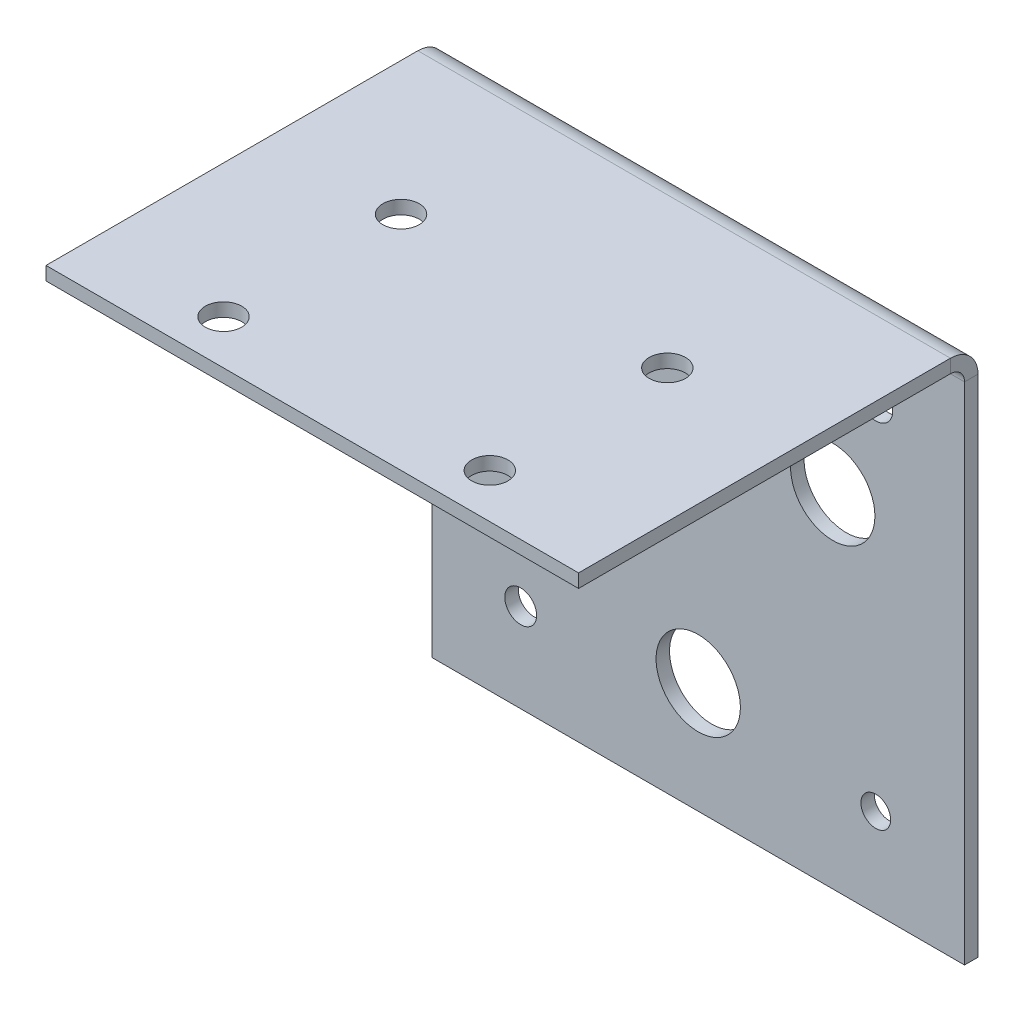
ISO-10303-21;
HEADER;
FILE_DESCRIPTION(('STEP AP214'),'2;1');
FILE_NAME('part.step','',(''),(''),'','','');
FILE_SCHEMA(('AUTOMOTIVE_DESIGN { 1 0 10303 214 1 1 1 1 }'));
ENDSEC;
DATA;
#1=APPLICATION_CONTEXT('core data for automotive mechanical design processes');
#2=APPLICATION_PROTOCOL_DEFINITION('international standard','automotive_design',2000,#1);
#3=PRODUCT_CONTEXT('',#1,'mechanical');
#4=PRODUCT('Part','Part','',(#3));
#5=PRODUCT_RELATED_PRODUCT_CATEGORY('part','',(#4));
#6=PRODUCT_DEFINITION_FORMATION('','',#4);
#7=PRODUCT_DEFINITION_CONTEXT('part definition',#1,'design');
#8=PRODUCT_DEFINITION('design','',#6,#7);
#9=PRODUCT_DEFINITION_SHAPE('','',#8);
#10=(LENGTH_UNIT() NAMED_UNIT(*) SI_UNIT(.MILLI.,.METRE.));
#11=(NAMED_UNIT(*) PLANE_ANGLE_UNIT() SI_UNIT($,.RADIAN.));
#12=(NAMED_UNIT(*) SI_UNIT($,.STERADIAN.) SOLID_ANGLE_UNIT());
#13=UNCERTAINTY_MEASURE_WITH_UNIT(LENGTH_MEASURE(1.E-05),#10,'distance_accuracy_value','');
#14=(GEOMETRIC_REPRESENTATION_CONTEXT(3) GLOBAL_UNCERTAINTY_ASSIGNED_CONTEXT((#13)) GLOBAL_UNIT_ASSIGNED_CONTEXT((#10,
#11,#12)) REPRESENTATION_CONTEXT('',''));
#15=CARTESIAN_POINT('',(0.,0.,0.));
#16=DIRECTION('',(0.,0.,1.));
#17=DIRECTION('',(1.,0.,0.));
#18=AXIS2_PLACEMENT_3D('',#15,#16,#17);
#19=CARTESIAN_POINT('',(-60.,60.,-3.03784));
#20=DIRECTION('',(-1.,0.,0.));
#21=DIRECTION('',(0.,-1.,0.));
#22=AXIS2_PLACEMENT_3D('',#19,#20,#21);
#23=PLANE('',#22);
#24=DIRECTION('',(0.,-1.,0.));
#25=VECTOR('',#24,1.);
#26=CARTESIAN_POINT('',(-60.,60.,0.));
#27=LINE('',#26,#25);
#28=CARTESIAN_POINT('',(-60.,53.78716,0.));
#29=VERTEX_POINT('',#28);
#30=CARTESIAN_POINT('',(-60.,-60.,0.));
#31=VERTEX_POINT('',#30);
#32=EDGE_CURVE('E104',#29,#31,#27,.T.);
#33=ORIENTED_EDGE('',*,*,#32,.F.);
#34=DIRECTION('',(0.,0.,-1.));
#35=VECTOR('',#34,1.);
#36=CARTESIAN_POINT('',(-60.,53.78716,0.));
#37=LINE('',#36,#35);
#38=CARTESIAN_POINT('',(-60.,53.78716,-3.03784));
#39=VERTEX_POINT('',#38);
#40=EDGE_CURVE('E134',#29,#39,#37,.T.);
#41=ORIENTED_EDGE('',*,*,#40,.T.);
#42=DIRECTION('',(0.,-1.,0.));
#43=VECTOR('',#42,1.);
#44=CARTESIAN_POINT('',(-60.,60.,-3.03784));
#45=LINE('',#44,#43);
#46=CARTESIAN_POINT('',(-60.,-60.,-3.03784));
#47=VERTEX_POINT('',#46);
#48=EDGE_CURVE('E111',#39,#47,#45,.T.);
#49=ORIENTED_EDGE('',*,*,#48,.T.);
#50=DIRECTION('',(0.,0.,1.));
#51=VECTOR('',#50,1.);
#52=CARTESIAN_POINT('',(-60.,-60.,-3.03784));
#53=LINE('',#52,#51);
#54=EDGE_CURVE('E63',#47,#31,#53,.T.);
#55=ORIENTED_EDGE('',*,*,#54,.T.);
#56=EDGE_LOOP('',(#33,#41,#49,#55));
#57=FACE_BOUND('',#56,.T.);
#58=ADVANCED_FACE('F59',(#57),#23,.T.);
#59=CARTESIAN_POINT('',(0.,0.,-3.03784));
#60=DIRECTION('',(0.,0.,1.));
#61=DIRECTION('',(1.,0.,0.));
#62=AXIS2_PLACEMENT_3D('',#59,#60,#61);
#63=PLANE('',#62);
#64=CARTESIAN_POINT('',(40.,40.,-3.03784));
#65=DIRECTION('',(0.,0.,-1.));
#66=DIRECTION('',(-1.,0.,0.));
#67=AXIS2_PLACEMENT_3D('',#64,#65,#66);
#68=CIRCLE('',#67,3.82819430211079);
#69=CARTESIAN_POINT('',(36.1718056978892,40.,-3.03784));
#70=VERTEX_POINT('',#69);
#71=EDGE_CURVE('E224',#70,#70,#68,.T.);
#72=ORIENTED_EDGE('',*,*,#71,.F.);
#73=EDGE_LOOP('',(#72));
#74=FACE_BOUND('',#73,.T.);
#75=CARTESIAN_POINT('',(40.,-40.,-3.03784));
#76=DIRECTION('',(0.,0.,-1.));
#77=DIRECTION('',(-1.,0.,0.));
#78=AXIS2_PLACEMENT_3D('',#75,#76,#77);
#79=CIRCLE('',#78,3.34967001434688);
#80=CARTESIAN_POINT('',(36.6503299856531,-40.,-3.03784));
#81=VERTEX_POINT('',#80);
#82=EDGE_CURVE('E230',#81,#81,#79,.T.);
#83=ORIENTED_EDGE('',*,*,#82,.F.);
#84=EDGE_LOOP('',(#83));
#85=FACE_BOUND('',#84,.T.);
#86=CARTESIAN_POINT('',(-40.,-40.,-3.03784));
#87=DIRECTION('',(0.,0.,-1.));
#88=DIRECTION('',(-1.,0.,0.));
#89=AXIS2_PLACEMENT_3D('',#86,#87,#88);
#90=CIRCLE('',#89,3.58893215822946);
#91=CARTESIAN_POINT('',(-43.5889321582295,-40.,-3.03784));
#92=VERTEX_POINT('',#91);
#93=EDGE_CURVE('E218',#92,#92,#90,.T.);
#94=ORIENTED_EDGE('',*,*,#93,.F.);
#95=EDGE_LOOP('',(#94));
#96=FACE_BOUND('',#95,.T.);
#97=CARTESIAN_POINT('',(-40.,40.,-3.03784));
#98=DIRECTION('',(0.,0.,-1.));
#99=DIRECTION('',(-1.,0.,0.));
#100=AXIS2_PLACEMENT_3D('',#97,#98,#99);
#101=CIRCLE('',#100,3.82819430211112);
#102=CARTESIAN_POINT('',(-43.8281943021111,40.,-3.03784));
#103=VERTEX_POINT('',#102);
#104=EDGE_CURVE('E201',#103,#103,#101,.T.);
#105=ORIENTED_EDGE('',*,*,#104,.F.);
#106=EDGE_LOOP('',(#105));
#107=FACE_BOUND('',#106,.T.);
#108=CARTESIAN_POINT('',(0.,-35.,-3.03784));
#109=DIRECTION('',(0.,0.,1.));
#110=DIRECTION('',(1.,0.,0.));
#111=AXIS2_PLACEMENT_3D('',#108,#109,#110);
#112=CIRCLE('',#111,9.5);
#113=CARTESIAN_POINT('',(9.50000000000001,-35.,-3.03784));
#114=VERTEX_POINT('',#113);
#115=EDGE_CURVE('E105',#114,#114,#112,.T.);
#116=ORIENTED_EDGE('',*,*,#115,.T.);
#117=EDGE_LOOP('',(#116));
#118=FACE_BOUND('',#117,.T.);
#119=CARTESIAN_POINT('',(-30.3108891324553,17.4999999999999,-3.03784));
#120=DIRECTION('',(0.,0.,1.));
#121=DIRECTION('',(1.,0.,0.));
#122=AXIS2_PLACEMENT_3D('',#119,#120,#121);
#123=CIRCLE('',#122,9.5);
#124=CARTESIAN_POINT('',(-20.8108891324553,17.4999999999999,-3.03784));
#125=VERTEX_POINT('',#124);
#126=EDGE_CURVE('E120',#125,#125,#123,.T.);
#127=ORIENTED_EDGE('',*,*,#126,.T.);
#128=EDGE_LOOP('',(#127));
#129=FACE_BOUND('',#128,.T.);
#130=CARTESIAN_POINT('',(30.3108891324553,17.4999999999999,-3.03784));
#131=DIRECTION('',(0.,0.,1.));
#132=DIRECTION('',(1.,0.,0.));
#133=AXIS2_PLACEMENT_3D('',#130,#131,#132);
#134=CIRCLE('',#133,9.5);
#135=CARTESIAN_POINT('',(39.8108891324553,17.4999999999999,-3.03784));
#136=VERTEX_POINT('',#135);
#137=EDGE_CURVE('E126',#136,#136,#134,.T.);
#138=ORIENTED_EDGE('',*,*,#137,.T.);
#139=EDGE_LOOP('',(#138));
#140=FACE_BOUND('',#139,.T.);
#141=DIRECTION('',(-1.,0.,0.));
#142=VECTOR('',#141,1.);
#143=CARTESIAN_POINT('',(-60.,53.78716,-3.03784));
#144=LINE('',#143,#142);
#145=CARTESIAN_POINT('',(60.,53.7871600000001,-3.03784));
#146=VERTEX_POINT('',#145);
#147=EDGE_CURVE('E150',#39,#146,#144,.F.);
#148=ORIENTED_EDGE('',*,*,#147,.T.);
#149=DIRECTION('',(0.,1.,0.));
#150=VECTOR('',#149,1.);
#151=CARTESIAN_POINT('',(60.,60.,-3.03784));
#152=LINE('',#151,#150);
#153=CARTESIAN_POINT('',(60.,-60.,-3.03784));
#154=VERTEX_POINT('',#153);
#155=EDGE_CURVE('E109',#154,#146,#152,.T.);
#156=ORIENTED_EDGE('',*,*,#155,.F.);
#157=DIRECTION('',(1.,0.,0.));
#158=VECTOR('',#157,1.);
#159=CARTESIAN_POINT('',(-60.,-60.,-3.03784));
#160=LINE('',#159,#158);
#161=EDGE_CURVE('E98',#47,#154,#160,.T.);
#162=ORIENTED_EDGE('',*,*,#161,.F.);
#163=ORIENTED_EDGE('',*,*,#48,.F.);
#164=EDGE_LOOP('',(#148,#156,#162,#163));
#165=FACE_BOUND('',#164,.T.);
#166=ADVANCED_FACE('F241',(#74,#85,#96,#107,#118,#129,#140,#165),#63,.F.);
#167=CARTESIAN_POINT('',(0.,0.,0.));
#168=DIRECTION('',(0.,0.,1.));
#169=DIRECTION('',(1.,0.,0.));
#170=AXIS2_PLACEMENT_3D('',#167,#168,#169);
#171=PLANE('',#170);
#172=CARTESIAN_POINT('',(40.,40.,0.));
#173=DIRECTION('',(0.,0.,1.));
#174=DIRECTION('',(1.,0.,0.));
#175=AXIS2_PLACEMENT_3D('',#172,#173,#174);
#176=CIRCLE('',#175,3.82819430211079);
#177=CARTESIAN_POINT('',(43.8281943021108,40.,0.));
#178=VERTEX_POINT('',#177);
#179=EDGE_CURVE('E221',#178,#178,#176,.F.);
#180=ORIENTED_EDGE('',*,*,#179,.T.);
#181=EDGE_LOOP('',(#180));
#182=FACE_BOUND('',#181,.T.);
#183=CARTESIAN_POINT('',(40.,-40.,0.));
#184=DIRECTION('',(0.,0.,1.));
#185=DIRECTION('',(1.,0.,0.));
#186=AXIS2_PLACEMENT_3D('',#183,#184,#185);
#187=CIRCLE('',#186,3.34967001434688);
#188=CARTESIAN_POINT('',(43.3496700143469,-40.,0.));
#189=VERTEX_POINT('',#188);
#190=EDGE_CURVE('E227',#189,#189,#187,.F.);
#191=ORIENTED_EDGE('',*,*,#190,.T.);
#192=EDGE_LOOP('',(#191));
#193=FACE_BOUND('',#192,.T.);
#194=CARTESIAN_POINT('',(-40.,-40.,0.));
#195=DIRECTION('',(0.,0.,1.));
#196=DIRECTION('',(1.,0.,0.));
#197=AXIS2_PLACEMENT_3D('',#194,#195,#196);
#198=CIRCLE('',#197,3.58893215822946);
#199=CARTESIAN_POINT('',(-36.4110678417705,-40.,0.));
#200=VERTEX_POINT('',#199);
#201=EDGE_CURVE('E233',#200,#200,#198,.F.);
#202=ORIENTED_EDGE('',*,*,#201,.T.);
#203=EDGE_LOOP('',(#202));
#204=FACE_BOUND('',#203,.T.);
#205=CARTESIAN_POINT('',(-40.,40.,0.));
#206=DIRECTION('',(0.,0.,1.));
#207=DIRECTION('',(1.,0.,0.));
#208=AXIS2_PLACEMENT_3D('',#205,#206,#207);
#209=CIRCLE('',#208,3.82819430211112);
#210=CARTESIAN_POINT('',(-36.1718056978889,40.,0.));
#211=VERTEX_POINT('',#210);
#212=EDGE_CURVE('E215',#211,#211,#209,.F.);
#213=ORIENTED_EDGE('',*,*,#212,.T.);
#214=EDGE_LOOP('',(#213));
#215=FACE_BOUND('',#214,.T.);
#216=CARTESIAN_POINT('',(30.3108891324553,17.4999999999999,0.));
#217=DIRECTION('',(0.,0.,1.));
#218=DIRECTION('',(1.,0.,0.));
#219=AXIS2_PLACEMENT_3D('',#216,#217,#218);
#220=CIRCLE('',#219,9.5);
#221=CARTESIAN_POINT('',(39.8108891324553,17.4999999999999,0.));
#222=VERTEX_POINT('',#221);
#223=EDGE_CURVE('E129',#222,#222,#220,.T.);
#224=ORIENTED_EDGE('',*,*,#223,.F.);
#225=EDGE_LOOP('',(#224));
#226=FACE_BOUND('',#225,.T.);
#227=CARTESIAN_POINT('',(-30.3108891324553,17.4999999999999,0.));
#228=DIRECTION('',(0.,0.,1.));
#229=DIRECTION('',(1.,0.,0.));
#230=AXIS2_PLACEMENT_3D('',#227,#228,#229);
#231=CIRCLE('',#230,9.5);
#232=CARTESIAN_POINT('',(-20.8108891324553,17.4999999999999,0.));
#233=VERTEX_POINT('',#232);
#234=EDGE_CURVE('E123',#233,#233,#231,.T.);
#235=ORIENTED_EDGE('',*,*,#234,.F.);
#236=EDGE_LOOP('',(#235));
#237=FACE_BOUND('',#236,.T.);
#238=CARTESIAN_POINT('',(0.,-35.,0.));
#239=DIRECTION('',(0.,0.,1.));
#240=DIRECTION('',(1.,0.,0.));
#241=AXIS2_PLACEMENT_3D('',#238,#239,#240);
#242=CIRCLE('',#241,9.5);
#243=CARTESIAN_POINT('',(9.50000000000001,-35.,0.));
#244=VERTEX_POINT('',#243);
#245=EDGE_CURVE('E117',#244,#244,#242,.T.);
#246=ORIENTED_EDGE('',*,*,#245,.F.);
#247=EDGE_LOOP('',(#246));
#248=FACE_BOUND('',#247,.T.);
#249=DIRECTION('',(0.,1.,0.));
#250=VECTOR('',#249,1.);
#251=CARTESIAN_POINT('',(60.,60.,0.));
#252=LINE('',#251,#250);
#253=CARTESIAN_POINT('',(60.,-60.,0.));
#254=VERTEX_POINT('',#253);
#255=CARTESIAN_POINT('',(60.,53.78716,0.));
#256=VERTEX_POINT('',#255);
#257=EDGE_CURVE('E100',#254,#256,#252,.T.);
#258=ORIENTED_EDGE('',*,*,#257,.T.);
#259=DIRECTION('',(-1.,0.,0.));
#260=VECTOR('',#259,1.);
#261=CARTESIAN_POINT('',(-60.,53.78716,0.));
#262=LINE('',#261,#260);
#263=EDGE_CURVE('E74',#29,#256,#262,.F.);
#264=ORIENTED_EDGE('',*,*,#263,.F.);
#265=ORIENTED_EDGE('',*,*,#32,.T.);
#266=DIRECTION('',(1.,0.,0.));
#267=VECTOR('',#266,1.);
#268=CARTESIAN_POINT('',(-60.,-60.,0.));
#269=LINE('',#268,#267);
#270=EDGE_CURVE('E96',#31,#254,#269,.T.);
#271=ORIENTED_EDGE('',*,*,#270,.T.);
#272=EDGE_LOOP('',(#258,#264,#265,#271));
#273=FACE_BOUND('',#272,.T.);
#274=ADVANCED_FACE('F107',(#182,#193,#204,#215,#226,#237,#248,#273),#171,.T.);
#275=CARTESIAN_POINT('',(60.,60.,-3.03784));
#276=DIRECTION('',(1.,0.,0.));
#277=DIRECTION('',(0.,1.,0.));
#278=AXIS2_PLACEMENT_3D('',#275,#276,#277);
#279=PLANE('',#278);
#280=DIRECTION('',(0.,0.,-1.));
#281=VECTOR('',#280,1.);
#282=CARTESIAN_POINT('',(60.,53.78716,0.));
#283=LINE('',#282,#281);
#284=EDGE_CURVE('E103',#256,#146,#283,.T.);
#285=ORIENTED_EDGE('',*,*,#284,.F.);
#286=ORIENTED_EDGE('',*,*,#257,.F.);
#287=DIRECTION('',(0.,0.,1.));
#288=VECTOR('',#287,1.);
#289=CARTESIAN_POINT('',(60.,-60.,-3.03784));
#290=LINE('',#289,#288);
#291=EDGE_CURVE('E13',#154,#254,#290,.T.);
#292=ORIENTED_EDGE('',*,*,#291,.F.);
#293=ORIENTED_EDGE('',*,*,#155,.T.);
#294=EDGE_LOOP('',(#285,#286,#292,#293));
#295=FACE_BOUND('',#294,.T.);
#296=ADVANCED_FACE('F61',(#295),#279,.T.);
#297=CARTESIAN_POINT('',(-60.,-60.,-3.03784));
#298=DIRECTION('',(0.,-1.,0.));
#299=DIRECTION('',(1.,0.,0.));
#300=AXIS2_PLACEMENT_3D('',#297,#298,#299);
#301=PLANE('',#300);
#302=ORIENTED_EDGE('',*,*,#270,.F.);
#303=ORIENTED_EDGE('',*,*,#54,.F.);
#304=ORIENTED_EDGE('',*,*,#161,.T.);
#305=ORIENTED_EDGE('',*,*,#291,.T.);
#306=EDGE_LOOP('',(#302,#303,#304,#305));
#307=FACE_BOUND('',#306,.T.);
#308=ADVANCED_FACE('F93',(#307),#301,.T.);
#309=CARTESIAN_POINT('',(0.,-35.,-3.03784));
#310=DIRECTION('',(0.,0.,1.));
#311=DIRECTION('',(1.,0.,0.));
#312=AXIS2_PLACEMENT_3D('',#309,#310,#311);
#313=CYLINDRICAL_SURFACE('',#312,9.5);
#314=ORIENTED_EDGE('',*,*,#115,.F.);
#315=EDGE_LOOP('',(#314));
#316=FACE_BOUND('',#315,.T.);
#317=ORIENTED_EDGE('',*,*,#245,.T.);
#318=EDGE_LOOP('',(#317));
#319=FACE_BOUND('',#318,.T.);
#320=ADVANCED_FACE('F314',(#316,#319),#313,.F.);
#321=CARTESIAN_POINT('',(-30.3108891324553,17.4999999999999,-3.03784));
#322=DIRECTION('',(0.,0.,1.));
#323=DIRECTION('',(1.,0.,0.));
#324=AXIS2_PLACEMENT_3D('',#321,#322,#323);
#325=CYLINDRICAL_SURFACE('',#324,9.5);
#326=ORIENTED_EDGE('',*,*,#126,.F.);
#327=EDGE_LOOP('',(#326));
#328=FACE_BOUND('',#327,.T.);
#329=ORIENTED_EDGE('',*,*,#234,.T.);
#330=EDGE_LOOP('',(#329));
#331=FACE_BOUND('',#330,.T.);
#332=ADVANCED_FACE('F320',(#328,#331),#325,.F.);
#333=CARTESIAN_POINT('',(30.3108891324553,17.4999999999999,-3.03784));
#334=DIRECTION('',(0.,0.,1.));
#335=DIRECTION('',(1.,0.,0.));
#336=AXIS2_PLACEMENT_3D('',#333,#334,#335);
#337=CYLINDRICAL_SURFACE('',#336,9.5);
#338=ORIENTED_EDGE('',*,*,#137,.F.);
#339=EDGE_LOOP('',(#338));
#340=FACE_BOUND('',#339,.T.);
#341=ORIENTED_EDGE('',*,*,#223,.T.);
#342=EDGE_LOOP('',(#341));
#343=FACE_BOUND('',#342,.T.);
#344=ADVANCED_FACE('F324',(#340,#343),#337,.F.);
#345=CARTESIAN_POINT('',(60.,53.78716,3.175));
#346=DIRECTION('',(1.,0.,0.));
#347=DIRECTION('',(0.,0.,-1.));
#348=AXIS2_PLACEMENT_3D('',#345,#346,#347);
#349=PLANE('',#348);
#350=DIRECTION('',(0.,-1.,0.));
#351=VECTOR('',#350,1.);
#352=CARTESIAN_POINT('',(60.,60.,3.17499999999998));
#353=LINE('',#352,#351);
#354=CARTESIAN_POINT('',(60.,56.96216,3.17499999999999));
#355=VERTEX_POINT('',#354);
#356=CARTESIAN_POINT('',(60.,60.,3.17499999999998));
#357=VERTEX_POINT('',#356);
#358=EDGE_CURVE('E155',#355,#357,#353,.F.);
#359=ORIENTED_EDGE('',*,*,#358,.F.);
#360=CARTESIAN_POINT('',(60.,53.78716,3.175));
#361=DIRECTION('',(-1.,0.,0.));
#362=DIRECTION('',(0.,0.,1.));
#363=AXIS2_PLACEMENT_3D('',#360,#361,#362);
#364=CIRCLE('',#363,3.175);
#365=EDGE_CURVE('E144',#256,#355,#364,.F.);
#366=ORIENTED_EDGE('',*,*,#365,.F.);
#367=ORIENTED_EDGE('',*,*,#284,.T.);
#368=CARTESIAN_POINT('',(60.,53.78716,3.175));
#369=DIRECTION('',(-1.,0.,0.));
#370=DIRECTION('',(0.,0.,1.));
#371=AXIS2_PLACEMENT_3D('',#368,#369,#370);
#372=CIRCLE('',#371,6.21284);
#373=EDGE_CURVE('E137',#146,#357,#372,.F.);
#374=ORIENTED_EDGE('',*,*,#373,.T.);
#375=EDGE_LOOP('',(#359,#366,#367,#374));
#376=FACE_BOUND('',#375,.T.);
#377=ADVANCED_FACE('F263',(#376),#349,.T.);
#378=CARTESIAN_POINT('',(-60.,53.78716,3.17499999999999));
#379=DIRECTION('',(1.,0.,0.));
#380=DIRECTION('',(0.,0.,-1.));
#381=AXIS2_PLACEMENT_3D('',#378,#379,#380);
#382=PLANE('',#381);
#383=CARTESIAN_POINT('',(-60.,53.78716,3.17499999999999));
#384=DIRECTION('',(-1.,0.,0.));
#385=DIRECTION('',(0.,0.,1.));
#386=AXIS2_PLACEMENT_3D('',#383,#384,#385);
#387=CIRCLE('',#386,3.175);
#388=CARTESIAN_POINT('',(-60.,56.96216,3.17499999999998));
#389=VERTEX_POINT('',#388);
#390=EDGE_CURVE('E139',#389,#29,#387,.T.);
#391=ORIENTED_EDGE('',*,*,#390,.F.);
#392=DIRECTION('',(0.,-1.,0.));
#393=VECTOR('',#392,1.);
#394=CARTESIAN_POINT('',(-60.,56.96216,3.17499999999998));
#395=LINE('',#394,#393);
#396=CARTESIAN_POINT('',(-60.,60.,3.17499999999997));
#397=VERTEX_POINT('',#396);
#398=EDGE_CURVE('E162',#389,#397,#395,.F.);
#399=ORIENTED_EDGE('',*,*,#398,.T.);
#400=CARTESIAN_POINT('',(-60.,53.78716,3.17499999999999));
#401=DIRECTION('',(-1.,0.,0.));
#402=DIRECTION('',(0.,0.,1.));
#403=AXIS2_PLACEMENT_3D('',#400,#401,#402);
#404=CIRCLE('',#403,6.21284);
#405=EDGE_CURVE('E147',#397,#39,#404,.T.);
#406=ORIENTED_EDGE('',*,*,#405,.T.);
#407=ORIENTED_EDGE('',*,*,#40,.F.);
#408=EDGE_LOOP('',(#391,#399,#406,#407));
#409=FACE_BOUND('',#408,.T.);
#410=ADVANCED_FACE('F306',(#409),#382,.F.);
#411=CARTESIAN_POINT('',(-60.,53.78716,3.17499999999999));
#412=DIRECTION('',(-1.,0.,0.));
#413=DIRECTION('',(0.,1.,0.));
#414=AXIS2_PLACEMENT_3D('',#411,#412,#413);
#415=CYLINDRICAL_SURFACE('',#414,6.21284);
#416=ORIENTED_EDGE('',*,*,#147,.F.);
#417=ORIENTED_EDGE('',*,*,#405,.F.);
#418=DIRECTION('',(-1.,0.,0.));
#419=VECTOR('',#418,1.);
#420=CARTESIAN_POINT('',(60.,60.,3.17499999999998));
#421=LINE('',#420,#419);
#422=EDGE_CURVE('E165',#397,#357,#421,.F.);
#423=ORIENTED_EDGE('',*,*,#422,.T.);
#424=ORIENTED_EDGE('',*,*,#373,.F.);
#425=EDGE_LOOP('',(#416,#417,#423,#424));
#426=FACE_BOUND('',#425,.T.);
#427=ADVANCED_FACE('F265',(#426),#415,.T.);
#428=CARTESIAN_POINT('',(-60.,53.78716,3.17499999999999));
#429=DIRECTION('',(-1.,0.,0.));
#430=DIRECTION('',(0.,1.,0.));
#431=AXIS2_PLACEMENT_3D('',#428,#429,#430);
#432=CYLINDRICAL_SURFACE('',#431,3.175);
#433=ORIENTED_EDGE('',*,*,#263,.T.);
#434=ORIENTED_EDGE('',*,*,#365,.T.);
#435=DIRECTION('',(-1.,0.,0.));
#436=VECTOR('',#435,1.);
#437=CARTESIAN_POINT('',(60.,56.96216,3.17499999999999));
#438=LINE('',#437,#436);
#439=EDGE_CURVE('E158',#355,#389,#438,.T.);
#440=ORIENTED_EDGE('',*,*,#439,.T.);
#441=ORIENTED_EDGE('',*,*,#390,.T.);
#442=EDGE_LOOP('',(#433,#434,#440,#441));
#443=FACE_BOUND('',#442,.T.);
#444=ADVANCED_FACE('F301',(#443),#432,.F.);
#445=CARTESIAN_POINT('',(60.,60.,0.));
#446=DIRECTION('',(-1.,0.,0.));
#447=DIRECTION('',(0.,0.,1.));
#448=AXIS2_PLACEMENT_3D('',#445,#446,#447);
#449=PLANE('',#448);
#450=ORIENTED_EDGE('',*,*,#358,.T.);
#451=DIRECTION('',(0.,0.,-1.));
#452=VECTOR('',#451,1.);
#453=CARTESIAN_POINT('',(60.,60.,-2.21257721971781E-13));
#454=LINE('',#453,#452);
#455=CARTESIAN_POINT('',(60.,60.0000000000003,86.96216));
#456=VERTEX_POINT('',#455);
#457=EDGE_CURVE('E177',#456,#357,#454,.T.);
#458=ORIENTED_EDGE('',*,*,#457,.F.);
#459=DIRECTION('',(0.,-1.,0.));
#460=VECTOR('',#459,1.);
#461=CARTESIAN_POINT('',(60.,60.0000000000003,86.96216));
#462=LINE('',#461,#460);
#463=CARTESIAN_POINT('',(60.,56.9621600000003,86.96216));
#464=VERTEX_POINT('',#463);
#465=EDGE_CURVE('E186',#456,#464,#462,.T.);
#466=ORIENTED_EDGE('',*,*,#465,.T.);
#467=DIRECTION('',(0.,0.,1.));
#468=VECTOR('',#467,1.);
#469=CARTESIAN_POINT('',(60.,56.96216,0.));
#470=LINE('',#469,#468);
#471=EDGE_CURVE('E168',#464,#355,#470,.F.);
#472=ORIENTED_EDGE('',*,*,#471,.T.);
#473=EDGE_LOOP('',(#450,#458,#466,#472));
#474=FACE_BOUND('',#473,.T.);
#475=ADVANCED_FACE('F335',(#474),#449,.F.);
#476=CARTESIAN_POINT('',(-60.,60.0000000000003,86.96216));
#477=DIRECTION('',(1.,0.,0.));
#478=DIRECTION('',(0.,0.,-1.));
#479=AXIS2_PLACEMENT_3D('',#476,#477,#478);
#480=PLANE('',#479);
#481=ORIENTED_EDGE('',*,*,#398,.F.);
#482=DIRECTION('',(0.,0.,-1.));
#483=VECTOR('',#482,1.);
#484=CARTESIAN_POINT('',(-60.,56.9621600000003,86.96216));
#485=LINE('',#484,#483);
#486=CARTESIAN_POINT('',(-60.,56.9621600000003,86.96216));
#487=VERTEX_POINT('',#486);
#488=EDGE_CURVE('E171',#389,#487,#485,.F.);
#489=ORIENTED_EDGE('',*,*,#488,.T.);
#490=DIRECTION('',(0.,-1.,0.));
#491=VECTOR('',#490,1.);
#492=CARTESIAN_POINT('',(-60.,60.0000000000003,86.96216));
#493=LINE('',#492,#491);
#494=CARTESIAN_POINT('',(-60.,60.0000000000003,86.96216));
#495=VERTEX_POINT('',#494);
#496=EDGE_CURVE('E142',#495,#487,#493,.T.);
#497=ORIENTED_EDGE('',*,*,#496,.F.);
#498=DIRECTION('',(0.,0.,1.));
#499=VECTOR('',#498,1.);
#500=CARTESIAN_POINT('',(-60.,60.,-2.16470195601295E-13));
#501=LINE('',#500,#499);
#502=EDGE_CURVE('E180',#397,#495,#501,.T.);
#503=ORIENTED_EDGE('',*,*,#502,.F.);
#504=EDGE_LOOP('',(#481,#489,#497,#503));
#505=FACE_BOUND('',#504,.T.);
#506=ADVANCED_FACE('F280',(#505),#480,.F.);
#507=CARTESIAN_POINT('',(0.,60.,-2.21257721971781E-13));
#508=DIRECTION('',(0.,-1.,0.));
#509=DIRECTION('',(0.,0.,-1.));
#510=AXIS2_PLACEMENT_3D('',#507,#508,#509);
#511=PLANE('',#510);
#512=CARTESIAN_POINT('',(30.,60.0000000000003,76.96216));
#513=DIRECTION('',(0.,1.,0.));
#514=DIRECTION('',(0.,0.,1.));
#515=AXIS2_PLACEMENT_3D('',#512,#513,#514);
#516=CIRCLE('',#515,4.10000000000001);
#517=CARTESIAN_POINT('',(30.,60.0000000000003,81.06216));
#518=VERTEX_POINT('',#517);
#519=EDGE_CURVE('E200',#518,#518,#516,.T.);
#520=ORIENTED_EDGE('',*,*,#519,.F.);
#521=EDGE_LOOP('',(#520));
#522=FACE_BOUND('',#521,.T.);
#523=CARTESIAN_POINT('',(30.,60.0000000000002,36.96216));
#524=DIRECTION('',(0.,1.,0.));
#525=DIRECTION('',(0.,0.,1.));
#526=AXIS2_PLACEMENT_3D('',#523,#524,#525);
#527=CIRCLE('',#526,4.1);
#528=CARTESIAN_POINT('',(30.,60.0000000000002,41.06216));
#529=VERTEX_POINT('',#528);
#530=EDGE_CURVE('E207',#529,#529,#527,.T.);
#531=ORIENTED_EDGE('',*,*,#530,.F.);
#532=EDGE_LOOP('',(#531));
#533=FACE_BOUND('',#532,.T.);
#534=CARTESIAN_POINT('',(-30.,60.0000000000002,36.96216));
#535=DIRECTION('',(0.,1.,0.));
#536=DIRECTION('',(0.,0.,1.));
#537=AXIS2_PLACEMENT_3D('',#534,#535,#536);
#538=CIRCLE('',#537,4.1);
#539=CARTESIAN_POINT('',(-30.,60.0000000000002,41.06216));
#540=VERTEX_POINT('',#539);
#541=EDGE_CURVE('E194',#540,#540,#538,.T.);
#542=ORIENTED_EDGE('',*,*,#541,.F.);
#543=EDGE_LOOP('',(#542));
#544=FACE_BOUND('',#543,.T.);
#545=CARTESIAN_POINT('',(-30.,60.0000000000003,76.96216));
#546=DIRECTION('',(0.,1.,0.));
#547=DIRECTION('',(0.,0.,1.));
#548=AXIS2_PLACEMENT_3D('',#545,#546,#547);
#549=CIRCLE('',#548,4.10000000000001);
#550=CARTESIAN_POINT('',(-30.,60.0000000000003,81.06216));
#551=VERTEX_POINT('',#550);
#552=EDGE_CURVE('E159',#551,#551,#549,.T.);
#553=ORIENTED_EDGE('',*,*,#552,.F.);
#554=EDGE_LOOP('',(#553));
#555=FACE_BOUND('',#554,.T.);
#556=ORIENTED_EDGE('',*,*,#422,.F.);
#557=ORIENTED_EDGE('',*,*,#502,.T.);
#558=DIRECTION('',(1.,0.,0.));
#559=VECTOR('',#558,1.);
#560=CARTESIAN_POINT('',(0.,60.0000000000003,86.96216));
#561=LINE('',#560,#559);
#562=EDGE_CURVE('E183',#495,#456,#561,.T.);
#563=ORIENTED_EDGE('',*,*,#562,.T.);
#564=ORIENTED_EDGE('',*,*,#457,.T.);
#565=EDGE_LOOP('',(#556,#557,#563,#564));
#566=FACE_BOUND('',#565,.T.);
#567=ADVANCED_FACE('F272',(#522,#533,#544,#555,#566),#511,.F.);
#568=CARTESIAN_POINT('',(0.,56.96216,-2.1065116030139E-13));
#569=DIRECTION('',(0.,-1.,0.));
#570=DIRECTION('',(0.,0.,-1.));
#571=AXIS2_PLACEMENT_3D('',#568,#569,#570);
#572=PLANE('',#571);
#573=CARTESIAN_POINT('',(30.,56.9621600000003,76.96216));
#574=DIRECTION('',(0.,-1.,0.));
#575=DIRECTION('',(0.,0.,-1.));
#576=AXIS2_PLACEMENT_3D('',#573,#574,#575);
#577=CIRCLE('',#576,4.10000000000001);
#578=CARTESIAN_POINT('',(30.,56.9621600000003,72.86216));
#579=VERTEX_POINT('',#578);
#580=EDGE_CURVE('E197',#579,#579,#577,.F.);
#581=ORIENTED_EDGE('',*,*,#580,.T.);
#582=EDGE_LOOP('',(#581));
#583=FACE_BOUND('',#582,.T.);
#584=CARTESIAN_POINT('',(30.,56.9621600000001,36.96216));
#585=DIRECTION('',(0.,-1.,0.));
#586=DIRECTION('',(0.,0.,-1.));
#587=AXIS2_PLACEMENT_3D('',#584,#585,#586);
#588=CIRCLE('',#587,4.1);
#589=CARTESIAN_POINT('',(30.,56.9621600000001,32.86216));
#590=VERTEX_POINT('',#589);
#591=EDGE_CURVE('E204',#590,#590,#588,.F.);
#592=ORIENTED_EDGE('',*,*,#591,.T.);
#593=EDGE_LOOP('',(#592));
#594=FACE_BOUND('',#593,.T.);
#595=CARTESIAN_POINT('',(-30.,56.9621600000001,36.96216));
#596=DIRECTION('',(0.,-1.,0.));
#597=DIRECTION('',(0.,0.,-1.));
#598=AXIS2_PLACEMENT_3D('',#595,#596,#597);
#599=CIRCLE('',#598,4.1);
#600=CARTESIAN_POINT('',(-30.,56.9621600000001,32.86216));
#601=VERTEX_POINT('',#600);
#602=EDGE_CURVE('E210',#601,#601,#599,.F.);
#603=ORIENTED_EDGE('',*,*,#602,.T.);
#604=EDGE_LOOP('',(#603));
#605=FACE_BOUND('',#604,.T.);
#606=CARTESIAN_POINT('',(-30.,56.9621600000003,76.96216));
#607=DIRECTION('',(0.,-1.,0.));
#608=DIRECTION('',(0.,0.,-1.));
#609=AXIS2_PLACEMENT_3D('',#606,#607,#608);
#610=CIRCLE('',#609,4.10000000000001);
#611=CARTESIAN_POINT('',(-30.,56.9621600000003,72.86216));
#612=VERTEX_POINT('',#611);
#613=EDGE_CURVE('E191',#612,#612,#610,.F.);
#614=ORIENTED_EDGE('',*,*,#613,.T.);
#615=EDGE_LOOP('',(#614));
#616=FACE_BOUND('',#615,.T.);
#617=ORIENTED_EDGE('',*,*,#488,.F.);
#618=ORIENTED_EDGE('',*,*,#439,.F.);
#619=ORIENTED_EDGE('',*,*,#471,.F.);
#620=DIRECTION('',(-1.,0.,0.));
#621=VECTOR('',#620,1.);
#622=CARTESIAN_POINT('',(60.,56.9621600000003,86.96216));
#623=LINE('',#622,#621);
#624=EDGE_CURVE('E174',#487,#464,#623,.F.);
#625=ORIENTED_EDGE('',*,*,#624,.F.);
#626=EDGE_LOOP('',(#617,#618,#619,#625));
#627=FACE_BOUND('',#626,.T.);
#628=ADVANCED_FACE('F346',(#583,#594,#605,#616,#627),#572,.T.);
#629=CARTESIAN_POINT('',(60.,60.0000000000003,86.96216));
#630=DIRECTION('',(0.,0.,-1.));
#631=DIRECTION('',(0.,1.,0.));
#632=AXIS2_PLACEMENT_3D('',#629,#630,#631);
#633=PLANE('',#632);
#634=ORIENTED_EDGE('',*,*,#624,.T.);
#635=ORIENTED_EDGE('',*,*,#465,.F.);
#636=ORIENTED_EDGE('',*,*,#562,.F.);
#637=ORIENTED_EDGE('',*,*,#496,.T.);
#638=EDGE_LOOP('',(#634,#635,#636,#637));
#639=FACE_BOUND('',#638,.T.);
#640=ADVANCED_FACE('F289',(#639),#633,.F.);
#641=CARTESIAN_POINT('',(-30.,-60.001,76.9621600000004));
#642=DIRECTION('',(0.,1.,0.));
#643=DIRECTION('',(0.,0.,1.));
#644=AXIS2_PLACEMENT_3D('',#641,#642,#643);
#645=CYLINDRICAL_SURFACE('',#644,4.10000000000001);
#646=ORIENTED_EDGE('',*,*,#613,.F.);
#647=EDGE_LOOP('',(#646));
#648=FACE_BOUND('',#647,.T.);
#649=ORIENTED_EDGE('',*,*,#552,.T.);
#650=EDGE_LOOP('',(#649));
#651=FACE_BOUND('',#650,.T.);
#652=ADVANCED_FACE('F345',(#648,#651),#645,.F.);
#653=CARTESIAN_POINT('',(-30.,-60.0010000000002,36.9621600000004));
#654=DIRECTION('',(0.,1.,0.));
#655=DIRECTION('',(0.,0.,1.));
#656=AXIS2_PLACEMENT_3D('',#653,#654,#655);
#657=CYLINDRICAL_SURFACE('',#656,4.1);
#658=ORIENTED_EDGE('',*,*,#602,.F.);
#659=EDGE_LOOP('',(#658));
#660=FACE_BOUND('',#659,.T.);
#661=ORIENTED_EDGE('',*,*,#541,.T.);
#662=EDGE_LOOP('',(#661));
#663=FACE_BOUND('',#662,.T.);
#664=ADVANCED_FACE('F355',(#660,#663),#657,.F.);
#665=CARTESIAN_POINT('',(30.,-60.0010000000002,36.9621600000004));
#666=DIRECTION('',(0.,1.,0.));
#667=DIRECTION('',(0.,0.,1.));
#668=AXIS2_PLACEMENT_3D('',#665,#666,#667);
#669=CYLINDRICAL_SURFACE('',#668,4.1);
#670=ORIENTED_EDGE('',*,*,#591,.F.);
#671=EDGE_LOOP('',(#670));
#672=FACE_BOUND('',#671,.T.);
#673=ORIENTED_EDGE('',*,*,#530,.T.);
#674=EDGE_LOOP('',(#673));
#675=FACE_BOUND('',#674,.T.);
#676=ADVANCED_FACE('F361',(#672,#675),#669,.F.);
#677=CARTESIAN_POINT('',(30.,-60.001,76.9621600000004));
#678=DIRECTION('',(0.,1.,0.));
#679=DIRECTION('',(0.,0.,1.));
#680=AXIS2_PLACEMENT_3D('',#677,#678,#679);
#681=CYLINDRICAL_SURFACE('',#680,4.10000000000001);
#682=ORIENTED_EDGE('',*,*,#580,.F.);
#683=EDGE_LOOP('',(#682));
#684=FACE_BOUND('',#683,.T.);
#685=ORIENTED_EDGE('',*,*,#519,.T.);
#686=EDGE_LOOP('',(#685));
#687=FACE_BOUND('',#686,.T.);
#688=ADVANCED_FACE('F357',(#684,#687),#681,.F.);
#689=CARTESIAN_POINT('',(-40.,40.,86.96316));
#690=DIRECTION('',(0.,0.,-1.));
#691=DIRECTION('',(-1.,0.,0.));
#692=AXIS2_PLACEMENT_3D('',#689,#690,#691);
#693=CYLINDRICAL_SURFACE('',#692,3.82819430211112);
#694=ORIENTED_EDGE('',*,*,#212,.F.);
#695=EDGE_LOOP('',(#694));
#696=FACE_BOUND('',#695,.T.);
#697=ORIENTED_EDGE('',*,*,#104,.T.);
#698=EDGE_LOOP('',(#697));
#699=FACE_BOUND('',#698,.T.);
#700=ADVANCED_FACE('F360',(#696,#699),#693,.F.);
#701=CARTESIAN_POINT('',(-40.,-40.,86.96316));
#702=DIRECTION('',(0.,0.,-1.));
#703=DIRECTION('',(-1.,0.,0.));
#704=AXIS2_PLACEMENT_3D('',#701,#702,#703);
#705=CYLINDRICAL_SURFACE('',#704,3.58893215822946);
#706=ORIENTED_EDGE('',*,*,#201,.F.);
#707=EDGE_LOOP('',(#706));
#708=FACE_BOUND('',#707,.T.);
#709=ORIENTED_EDGE('',*,*,#93,.T.);
#710=EDGE_LOOP('',(#709));
#711=FACE_BOUND('',#710,.T.);
#712=ADVANCED_FACE('F239',(#708,#711),#705,.F.);
#713=CARTESIAN_POINT('',(40.,-40.,86.96316));
#714=DIRECTION('',(0.,0.,-1.));
#715=DIRECTION('',(-1.,0.,0.));
#716=AXIS2_PLACEMENT_3D('',#713,#714,#715);
#717=CYLINDRICAL_SURFACE('',#716,3.34967001434688);
#718=ORIENTED_EDGE('',*,*,#190,.F.);
#719=EDGE_LOOP('',(#718));
#720=FACE_BOUND('',#719,.T.);
#721=ORIENTED_EDGE('',*,*,#82,.T.);
#722=EDGE_LOOP('',(#721));
#723=FACE_BOUND('',#722,.T.);
#724=ADVANCED_FACE('F375',(#720,#723),#717,.F.);
#725=CARTESIAN_POINT('',(40.,40.,86.96316));
#726=DIRECTION('',(0.,0.,-1.));
#727=DIRECTION('',(-1.,0.,0.));
#728=AXIS2_PLACEMENT_3D('',#725,#726,#727);
#729=CYLINDRICAL_SURFACE('',#728,3.82819430211079);
#730=ORIENTED_EDGE('',*,*,#179,.F.);
#731=EDGE_LOOP('',(#730));
#732=FACE_BOUND('',#731,.T.);
#733=ORIENTED_EDGE('',*,*,#71,.T.);
#734=EDGE_LOOP('',(#733));
#735=FACE_BOUND('',#734,.T.);
#736=ADVANCED_FACE('F372',(#732,#735),#729,.F.);
#737=CLOSED_SHELL('',(#58,#166,#274,#296,#308,#320,#332,#344,#377,#410,#427,#444,#475,#506,#567,
#628,#640,#652,#664,#676,#688,#700,#712,#724,#736));
#738=MANIFOLD_SOLID_BREP('B2',#737);
#739=ADVANCED_BREP_SHAPE_REPRESENTATION('',(#18,#738),#14);
#740=SHAPE_DEFINITION_REPRESENTATION(#9,#739);
ENDSEC;
END-ISO-10303-21;
